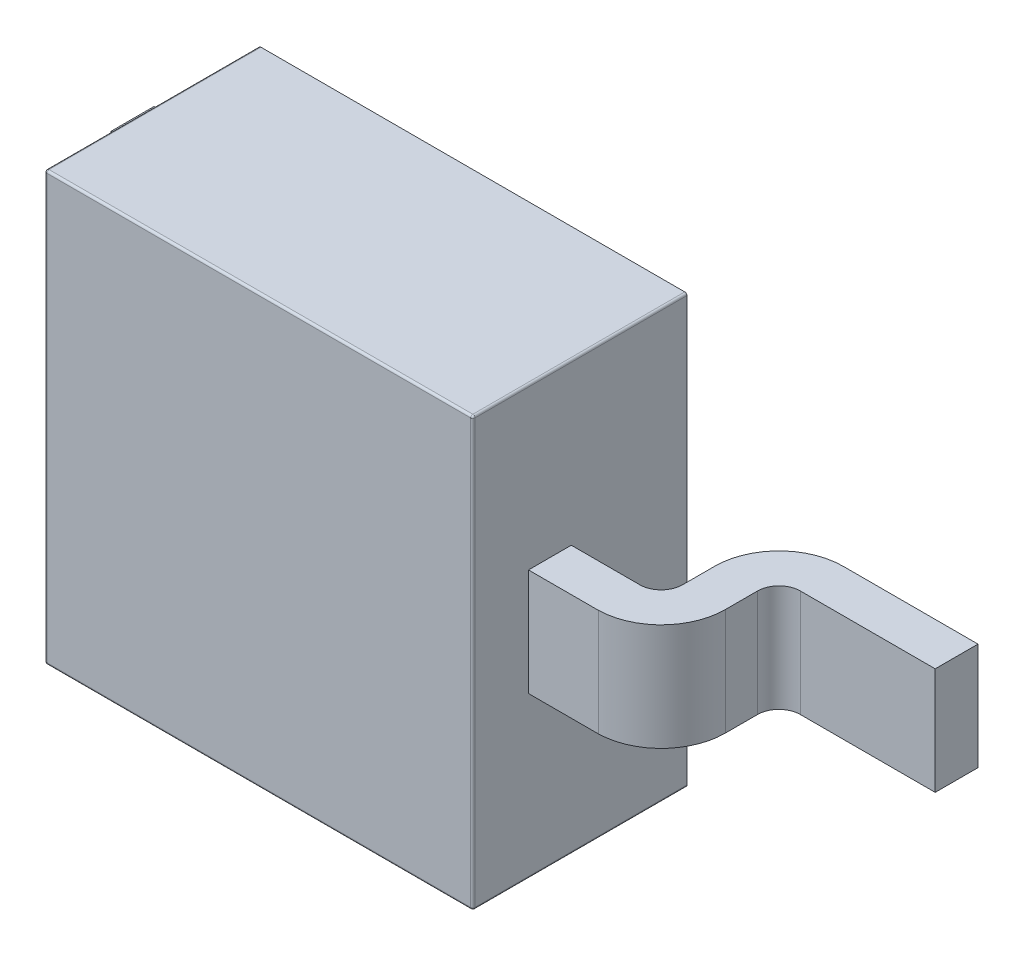
ISO-10303-21;
HEADER;
FILE_DESCRIPTION(('STEP AP214'),'2;1');
FILE_NAME('part.step','',(''),(''),'','','');
FILE_SCHEMA(('AUTOMOTIVE_DESIGN { 1 0 10303 214 1 1 1 1 }'));
ENDSEC;
DATA;
#1=APPLICATION_CONTEXT('core data for automotive mechanical design processes');
#2=APPLICATION_PROTOCOL_DEFINITION('international standard','automotive_design',2000,#1);
#3=PRODUCT_CONTEXT('',#1,'mechanical');
#4=PRODUCT('Part','Part','',(#3));
#5=PRODUCT_RELATED_PRODUCT_CATEGORY('part','',(#4));
#6=PRODUCT_DEFINITION_FORMATION('','',#4);
#7=PRODUCT_DEFINITION_CONTEXT('part definition',#1,'design');
#8=PRODUCT_DEFINITION('design','',#6,#7);
#9=PRODUCT_DEFINITION_SHAPE('','',#8);
#10=(LENGTH_UNIT() NAMED_UNIT(*) SI_UNIT(.MILLI.,.METRE.));
#11=(NAMED_UNIT(*) PLANE_ANGLE_UNIT() SI_UNIT($,.RADIAN.));
#12=(NAMED_UNIT(*) SI_UNIT($,.STERADIAN.) SOLID_ANGLE_UNIT());
#13=UNCERTAINTY_MEASURE_WITH_UNIT(LENGTH_MEASURE(1.E-05),#10,'distance_accuracy_value','');
#14=(GEOMETRIC_REPRESENTATION_CONTEXT(3) GLOBAL_UNCERTAINTY_ASSIGNED_CONTEXT((#13)) GLOBAL_UNIT_ASSIGNED_CONTEXT((#10,
#11,#12)) REPRESENTATION_CONTEXT('',''));
#15=CARTESIAN_POINT('',(0.,0.,0.));
#16=DIRECTION('',(0.,0.,1.));
#17=DIRECTION('',(1.,0.,0.));
#18=AXIS2_PLACEMENT_3D('',#15,#16,#17);
#19=CARTESIAN_POINT('',(1.,1.,1.01));
#20=DIRECTION('',(-1.,0.,0.));
#21=DIRECTION('',(0.,-1.,0.));
#22=AXIS2_PLACEMENT_3D('',#19,#20,#21);
#23=PLANE('',#22);
#24=DIRECTION('',(0.,1.,0.));
#25=VECTOR('',#24,1.);
#26=CARTESIAN_POINT('',(1.,-1.,1.));
#27=LINE('',#26,#25);
#28=CARTESIAN_POINT('',(1.,0.99,1.));
#29=VERTEX_POINT('',#28);
#30=CARTESIAN_POINT('',(1.,-0.99,1.));
#31=VERTEX_POINT('',#30);
#32=EDGE_CURVE('E399',#29,#31,#27,.F.);
#33=ORIENTED_EDGE('',*,*,#32,.T.);
#34=DIRECTION('',(0.,0.,-1.));
#35=VECTOR('',#34,1.);
#36=CARTESIAN_POINT('',(1.,-0.99,1.01));
#37=LINE('',#36,#35);
#38=CARTESIAN_POINT('',(1.,-0.99,0.01));
#39=VERTEX_POINT('',#38);
#40=EDGE_CURVE('E403',#31,#39,#37,.T.);
#41=ORIENTED_EDGE('',*,*,#40,.T.);
#42=DIRECTION('',(0.,1.,0.));
#43=VECTOR('',#42,1.);
#44=CARTESIAN_POINT('',(1.,1.,0.01));
#45=LINE('',#44,#43);
#46=CARTESIAN_POINT('',(1.,0.99,0.01));
#47=VERTEX_POINT('',#46);
#48=EDGE_CURVE('E341',#39,#47,#45,.T.);
#49=ORIENTED_EDGE('',*,*,#48,.T.);
#50=DIRECTION('',(0.,0.,-1.));
#51=VECTOR('',#50,1.);
#52=CARTESIAN_POINT('',(1.,0.99,1.01));
#53=LINE('',#52,#51);
#54=EDGE_CURVE('E401',#47,#29,#53,.F.);
#55=ORIENTED_EDGE('',*,*,#54,.T.);
#56=EDGE_LOOP('',(#33,#41,#49,#55));
#57=FACE_BOUND('',#56,.T.);
#58=DIRECTION('',(0.,0.,-1.));
#59=VECTOR('',#58,1.);
#60=CARTESIAN_POINT('',(1.,0.25,0.75));
#61=LINE('',#60,#59);
#62=CARTESIAN_POINT('',(1.,0.25,0.75));
#63=VERTEX_POINT('',#62);
#64=CARTESIAN_POINT('',(1.,0.25,0.550107802640043));
#65=VERTEX_POINT('',#64);
#66=EDGE_CURVE('E285',#63,#65,#61,.T.);
#67=ORIENTED_EDGE('',*,*,#66,.T.);
#68=DIRECTION('',(0.,-1.,0.));
#69=VECTOR('',#68,1.);
#70=CARTESIAN_POINT('',(1.,1.,0.550107802640043));
#71=LINE('',#70,#69);
#72=CARTESIAN_POINT('',(1.,-0.25,0.550107802640043));
#73=VERTEX_POINT('',#72);
#74=EDGE_CURVE('E224',#65,#73,#71,.T.);
#75=ORIENTED_EDGE('',*,*,#74,.T.);
#76=DIRECTION('',(0.,0.,-1.));
#77=VECTOR('',#76,1.);
#78=CARTESIAN_POINT('',(1.,-0.25,0.75));
#79=LINE('',#78,#77);
#80=CARTESIAN_POINT('',(1.,-0.25,0.75));
#81=VERTEX_POINT('',#80);
#82=EDGE_CURVE('E238',#81,#73,#79,.T.);
#83=ORIENTED_EDGE('',*,*,#82,.F.);
#84=DIRECTION('',(0.,-1.,0.));
#85=VECTOR('',#84,1.);
#86=CARTESIAN_POINT('',(1.,0.25,0.75));
#87=LINE('',#86,#85);
#88=EDGE_CURVE('E276',#63,#81,#87,.T.);
#89=ORIENTED_EDGE('',*,*,#88,.F.);
#90=EDGE_LOOP('',(#67,#75,#83,#89));
#91=FACE_BOUND('',#90,.T.);
#92=ADVANCED_FACE('F30',(#57,#91),#23,.F.);
#93=CARTESIAN_POINT('',(-1.,1.,1.01));
#94=DIRECTION('',(1.,0.,0.));
#95=DIRECTION('',(0.,0.,-1.));
#96=AXIS2_PLACEMENT_3D('',#93,#94,#95);
#97=PLANE('',#96);
#98=DIRECTION('',(0.,-1.,0.));
#99=VECTOR('',#98,1.);
#100=CARTESIAN_POINT('',(-1.,1.,0.01));
#101=LINE('',#100,#99);
#102=CARTESIAN_POINT('',(-1.,-0.5,0.01));
#103=VERTEX_POINT('',#102);
#104=CARTESIAN_POINT('',(-1.,-0.99,0.01));
#105=VERTEX_POINT('',#104);
#106=EDGE_CURVE('E335',#103,#105,#101,.T.);
#107=ORIENTED_EDGE('',*,*,#106,.T.);
#108=DIRECTION('',(0.,0.,-1.));
#109=VECTOR('',#108,1.);
#110=CARTESIAN_POINT('',(-1.,-0.99,1.01));
#111=LINE('',#110,#109);
#112=CARTESIAN_POINT('',(-1.,-0.99,1.));
#113=VERTEX_POINT('',#112);
#114=EDGE_CURVE('E397',#105,#113,#111,.F.);
#115=ORIENTED_EDGE('',*,*,#114,.T.);
#116=DIRECTION('',(0.,-1.,0.));
#117=VECTOR('',#116,1.);
#118=CARTESIAN_POINT('',(-1.,1.,1.));
#119=LINE('',#118,#117);
#120=CARTESIAN_POINT('',(-1.,0.99,1.));
#121=VERTEX_POINT('',#120);
#122=EDGE_CURVE('E393',#113,#121,#119,.F.);
#123=ORIENTED_EDGE('',*,*,#122,.T.);
#124=DIRECTION('',(0.,0.,-1.));
#125=VECTOR('',#124,1.);
#126=CARTESIAN_POINT('',(-1.,0.99,1.01));
#127=LINE('',#126,#125);
#128=CARTESIAN_POINT('',(-1.,0.99,0.01));
#129=VERTEX_POINT('',#128);
#130=EDGE_CURVE('E395',#121,#129,#127,.T.);
#131=ORIENTED_EDGE('',*,*,#130,.T.);
#132=CARTESIAN_POINT('',(-1.,0.5,0.01));
#133=VERTEX_POINT('',#132);
#134=EDGE_CURVE('E336',#129,#133,#101,.T.);
#135=ORIENTED_EDGE('',*,*,#134,.T.);
#136=DIRECTION('',(0.,0.,-1.));
#137=VECTOR('',#136,1.);
#138=CARTESIAN_POINT('',(-1.,0.5,1.01));
#139=LINE('',#138,#137);
#140=CARTESIAN_POINT('',(-1.,0.5,0.2));
#141=VERTEX_POINT('',#140);
#142=EDGE_CURVE('E329',#141,#133,#139,.T.);
#143=ORIENTED_EDGE('',*,*,#142,.F.);
#144=DIRECTION('',(0.,-1.,0.));
#145=VECTOR('',#144,1.);
#146=CARTESIAN_POINT('',(-1.,1.,0.2));
#147=LINE('',#146,#145);
#148=CARTESIAN_POINT('',(-1.,-0.5,0.2));
#149=VERTEX_POINT('',#148);
#150=EDGE_CURVE('E356',#141,#149,#147,.T.);
#151=ORIENTED_EDGE('',*,*,#150,.T.);
#152=DIRECTION('',(0.,0.,1.));
#153=VECTOR('',#152,1.);
#154=CARTESIAN_POINT('',(-1.,-0.5,1.01));
#155=LINE('',#154,#153);
#156=EDGE_CURVE('E332',#103,#149,#155,.T.);
#157=ORIENTED_EDGE('',*,*,#156,.F.);
#158=EDGE_LOOP('',(#107,#115,#123,#131,#135,#143,#151,#157));
#159=FACE_BOUND('',#158,.T.);
#160=ADVANCED_FACE('F512',(#159),#97,.F.);
#161=CARTESIAN_POINT('',(-1.,-1.,0.01));
#162=DIRECTION('',(0.,0.,1.));
#163=DIRECTION('',(1.,0.,0.));
#164=AXIS2_PLACEMENT_3D('',#161,#162,#163);
#165=PLANE('',#164);
#166=DIRECTION('',(1.,0.,0.));
#167=VECTOR('',#166,1.);
#168=CARTESIAN_POINT('',(-1.,-1.,0.01));
#169=LINE('',#168,#167);
#170=CARTESIAN_POINT('',(-0.99,-1.,0.01));
#171=VERTEX_POINT('',#170);
#172=CARTESIAN_POINT('',(0.99,-1.,0.01));
#173=VERTEX_POINT('',#172);
#174=EDGE_CURVE('E338',#171,#173,#169,.T.);
#175=ORIENTED_EDGE('',*,*,#174,.F.);
#176=CARTESIAN_POINT('',(-0.99,-0.99,0.01));
#177=DIRECTION('',(0.,0.,1.));
#178=DIRECTION('',(1.,0.,0.));
#179=AXIS2_PLACEMENT_3D('',#176,#177,#178);
#180=CIRCLE('',#179,0.01);
#181=EDGE_CURVE('E391',#171,#105,#180,.F.);
#182=ORIENTED_EDGE('',*,*,#181,.T.);
#183=ORIENTED_EDGE('',*,*,#106,.F.);
#184=DIRECTION('',(-1.,0.,0.));
#185=VECTOR('',#184,1.);
#186=CARTESIAN_POINT('',(-1.,-0.5,0.01));
#187=LINE('',#186,#185);
#188=CARTESIAN_POINT('',(0.5,-0.5,0.01));
#189=VERTEX_POINT('',#188);
#190=EDGE_CURVE('E353',#189,#103,#187,.T.);
#191=ORIENTED_EDGE('',*,*,#190,.F.);
#192=DIRECTION('',(0.,-1.,0.));
#193=VECTOR('',#192,1.);
#194=CARTESIAN_POINT('',(0.5,-1.,0.01));
#195=LINE('',#194,#193);
#196=CARTESIAN_POINT('',(0.5,0.5,0.01));
#197=VERTEX_POINT('',#196);
#198=EDGE_CURVE('E350',#197,#189,#195,.T.);
#199=ORIENTED_EDGE('',*,*,#198,.F.);
#200=DIRECTION('',(1.,0.,0.));
#201=VECTOR('',#200,1.);
#202=CARTESIAN_POINT('',(-1.,0.5,0.01));
#203=LINE('',#202,#201);
#204=EDGE_CURVE('E347',#133,#197,#203,.T.);
#205=ORIENTED_EDGE('',*,*,#204,.F.);
#206=ORIENTED_EDGE('',*,*,#134,.F.);
#207=CARTESIAN_POINT('',(-0.99,0.99,0.01));
#208=DIRECTION('',(0.,0.,1.));
#209=DIRECTION('',(1.,0.,0.));
#210=AXIS2_PLACEMENT_3D('',#207,#208,#209);
#211=CIRCLE('',#210,0.01);
#212=CARTESIAN_POINT('',(-0.99,1.,0.01));
#213=VERTEX_POINT('',#212);
#214=EDGE_CURVE('E387',#129,#213,#211,.F.);
#215=ORIENTED_EDGE('',*,*,#214,.T.);
#216=DIRECTION('',(-1.,0.,0.));
#217=VECTOR('',#216,1.);
#218=CARTESIAN_POINT('',(-1.,1.,0.01));
#219=LINE('',#218,#217);
#220=CARTESIAN_POINT('',(0.99,1.,0.01));
#221=VERTEX_POINT('',#220);
#222=EDGE_CURVE('E344',#221,#213,#219,.T.);
#223=ORIENTED_EDGE('',*,*,#222,.F.);
#224=CARTESIAN_POINT('',(0.99,0.99,0.01));
#225=DIRECTION('',(0.,0.,1.));
#226=DIRECTION('',(1.,0.,0.));
#227=AXIS2_PLACEMENT_3D('',#224,#225,#226);
#228=CIRCLE('',#227,0.01);
#229=EDGE_CURVE('E385',#221,#47,#228,.F.);
#230=ORIENTED_EDGE('',*,*,#229,.T.);
#231=ORIENTED_EDGE('',*,*,#48,.F.);
#232=CARTESIAN_POINT('',(0.99,-0.99,0.01));
#233=DIRECTION('',(0.,0.,1.));
#234=DIRECTION('',(1.,0.,0.));
#235=AXIS2_PLACEMENT_3D('',#232,#233,#234);
#236=CIRCLE('',#235,0.01);
#237=EDGE_CURVE('E389',#39,#173,#236,.F.);
#238=ORIENTED_EDGE('',*,*,#237,.T.);
#239=EDGE_LOOP('',(#175,#182,#183,#191,#199,#205,#206,#215,#223,#230,#231,#238));
#240=FACE_BOUND('',#239,.T.);
#241=ADVANCED_FACE('F463',(#240),#165,.F.);
#242=CARTESIAN_POINT('',(-1.,-1.,1.01));
#243=DIRECTION('',(0.,1.,0.));
#244=DIRECTION('',(0.,0.,1.));
#245=AXIS2_PLACEMENT_3D('',#242,#243,#244);
#246=PLANE('',#245);
#247=DIRECTION('',(1.,0.,0.));
#248=VECTOR('',#247,1.);
#249=CARTESIAN_POINT('',(-1.,-1.,1.));
#250=LINE('',#249,#248);
#251=CARTESIAN_POINT('',(0.99,-1.,1.));
#252=VERTEX_POINT('',#251);
#253=CARTESIAN_POINT('',(-0.99,-1.,1.));
#254=VERTEX_POINT('',#253);
#255=EDGE_CURVE('E378',#252,#254,#250,.F.);
#256=ORIENTED_EDGE('',*,*,#255,.T.);
#257=DIRECTION('',(0.,0.,-1.));
#258=VECTOR('',#257,1.);
#259=CARTESIAN_POINT('',(-0.99,-1.,1.01));
#260=LINE('',#259,#258);
#261=EDGE_CURVE('E382',#254,#171,#260,.T.);
#262=ORIENTED_EDGE('',*,*,#261,.T.);
#263=ORIENTED_EDGE('',*,*,#174,.T.);
#264=DIRECTION('',(0.,0.,-1.));
#265=VECTOR('',#264,1.);
#266=CARTESIAN_POINT('',(0.99,-1.,1.01));
#267=LINE('',#266,#265);
#268=EDGE_CURVE('E380',#173,#252,#267,.F.);
#269=ORIENTED_EDGE('',*,*,#268,.T.);
#270=EDGE_LOOP('',(#256,#262,#263,#269));
#271=FACE_BOUND('',#270,.T.);
#272=ADVANCED_FACE('F504',(#271),#246,.F.);
#273=CARTESIAN_POINT('',(-1.,1.,1.01));
#274=DIRECTION('',(0.,-1.,0.));
#275=DIRECTION('',(0.,0.,-1.));
#276=AXIS2_PLACEMENT_3D('',#273,#274,#275);
#277=PLANE('',#276);
#278=ORIENTED_EDGE('',*,*,#222,.T.);
#279=DIRECTION('',(0.,0.,-1.));
#280=VECTOR('',#279,1.);
#281=CARTESIAN_POINT('',(-0.99,1.,1.01));
#282=LINE('',#281,#280);
#283=CARTESIAN_POINT('',(-0.99,1.,1.));
#284=VERTEX_POINT('',#283);
#285=EDGE_CURVE('E409',#213,#284,#282,.F.);
#286=ORIENTED_EDGE('',*,*,#285,.T.);
#287=DIRECTION('',(-1.,0.,0.));
#288=VECTOR('',#287,1.);
#289=CARTESIAN_POINT('',(1.,1.,1.));
#290=LINE('',#289,#288);
#291=CARTESIAN_POINT('',(0.99,1.,1.));
#292=VERTEX_POINT('',#291);
#293=EDGE_CURVE('E405',#284,#292,#290,.F.);
#294=ORIENTED_EDGE('',*,*,#293,.T.);
#295=DIRECTION('',(0.,0.,-1.));
#296=VECTOR('',#295,1.);
#297=CARTESIAN_POINT('',(0.99,1.,1.01));
#298=LINE('',#297,#296);
#299=EDGE_CURVE('E407',#292,#221,#298,.T.);
#300=ORIENTED_EDGE('',*,*,#299,.T.);
#301=EDGE_LOOP('',(#278,#286,#294,#300));
#302=FACE_BOUND('',#301,.T.);
#303=ADVANCED_FACE('F459',(#302),#277,.F.);
#304=CARTESIAN_POINT('',(-1.,-1.,1.01));
#305=DIRECTION('',(0.,0.,1.));
#306=DIRECTION('',(1.,0.,0.));
#307=AXIS2_PLACEMENT_3D('',#304,#305,#306);
#308=PLANE('',#307);
#309=DIRECTION('',(0.,1.,0.));
#310=VECTOR('',#309,1.);
#311=CARTESIAN_POINT('',(0.99,1.,1.01));
#312=LINE('',#311,#310);
#313=CARTESIAN_POINT('',(0.99,-0.99,1.01));
#314=VERTEX_POINT('',#313);
#315=CARTESIAN_POINT('',(0.99,0.99,1.01));
#316=VERTEX_POINT('',#315);
#317=EDGE_CURVE('E39',#314,#316,#312,.T.);
#318=ORIENTED_EDGE('',*,*,#317,.T.);
#319=DIRECTION('',(-1.,0.,0.));
#320=VECTOR('',#319,1.);
#321=CARTESIAN_POINT('',(-1.,0.99,1.01));
#322=LINE('',#321,#320);
#323=CARTESIAN_POINT('',(-0.99,0.99,1.01));
#324=VERTEX_POINT('',#323);
#325=EDGE_CURVE('E11',#316,#324,#322,.T.);
#326=ORIENTED_EDGE('',*,*,#325,.T.);
#327=DIRECTION('',(0.,-1.,0.));
#328=VECTOR('',#327,1.);
#329=CARTESIAN_POINT('',(-0.99,-1.,1.01));
#330=LINE('',#329,#328);
#331=CARTESIAN_POINT('',(-0.99,-0.99,1.01));
#332=VERTEX_POINT('',#331);
#333=EDGE_CURVE('E413',#324,#332,#330,.T.);
#334=ORIENTED_EDGE('',*,*,#333,.T.);
#335=DIRECTION('',(1.,0.,0.));
#336=VECTOR('',#335,1.);
#337=CARTESIAN_POINT('',(1.,-0.99,1.01));
#338=LINE('',#337,#336);
#339=EDGE_CURVE('E411',#332,#314,#338,.T.);
#340=ORIENTED_EDGE('',*,*,#339,.T.);
#341=EDGE_LOOP('',(#318,#326,#334,#340));
#342=FACE_BOUND('',#341,.T.);
#343=ADVANCED_FACE('F482',(#342),#308,.T.);
#344=CARTESIAN_POINT('',(-1.5,-0.5,0.2));
#345=DIRECTION('',(0.,0.,1.));
#346=DIRECTION('',(1.,0.,0.));
#347=AXIS2_PLACEMENT_3D('',#344,#345,#346);
#348=PLANE('',#347);
#349=ORIENTED_EDGE('',*,*,#150,.F.);
#350=DIRECTION('',(-1.,0.,0.));
#351=VECTOR('',#350,1.);
#352=CARTESIAN_POINT('',(-1.5,0.5,0.2));
#353=LINE('',#352,#351);
#354=CARTESIAN_POINT('',(-1.5,0.5,0.2));
#355=VERTEX_POINT('',#354);
#356=EDGE_CURVE('E308',#141,#355,#353,.T.);
#357=ORIENTED_EDGE('',*,*,#356,.T.);
#358=DIRECTION('',(0.,-1.,0.));
#359=VECTOR('',#358,1.);
#360=CARTESIAN_POINT('',(-1.5,0.5,0.2));
#361=LINE('',#360,#359);
#362=CARTESIAN_POINT('',(-1.5,-0.5,0.2));
#363=VERTEX_POINT('',#362);
#364=EDGE_CURVE('E301',#355,#363,#361,.T.);
#365=ORIENTED_EDGE('',*,*,#364,.T.);
#366=DIRECTION('',(1.,0.,0.));
#367=VECTOR('',#366,1.);
#368=CARTESIAN_POINT('',(-1.5,-0.5,0.2));
#369=LINE('',#368,#367);
#370=EDGE_CURVE('E304',#363,#149,#369,.T.);
#371=ORIENTED_EDGE('',*,*,#370,.T.);
#372=EDGE_LOOP('',(#349,#357,#365,#371));
#373=FACE_BOUND('',#372,.T.);
#374=ADVANCED_FACE('F518',(#373),#348,.T.);
#375=CARTESIAN_POINT('',(-1.5,-0.5,0.2));
#376=DIRECTION('',(0.,1.,0.));
#377=DIRECTION('',(0.,0.,1.));
#378=AXIS2_PLACEMENT_3D('',#375,#376,#377);
#379=PLANE('',#378);
#380=ORIENTED_EDGE('',*,*,#190,.T.);
#381=ORIENTED_EDGE('',*,*,#156,.T.);
#382=ORIENTED_EDGE('',*,*,#370,.F.);
#383=DIRECTION('',(0.,0.,-1.));
#384=VECTOR('',#383,1.);
#385=CARTESIAN_POINT('',(-1.5,-0.5,0.2));
#386=LINE('',#385,#384);
#387=CARTESIAN_POINT('',(-1.5,-0.5,0.));
#388=VERTEX_POINT('',#387);
#389=EDGE_CURVE('E326',#363,#388,#386,.T.);
#390=ORIENTED_EDGE('',*,*,#389,.T.);
#391=DIRECTION('',(1.,0.,0.));
#392=VECTOR('',#391,1.);
#393=CARTESIAN_POINT('',(-1.5,-0.5,0.));
#394=LINE('',#393,#392);
#395=CARTESIAN_POINT('',(0.5,-0.5,0.));
#396=VERTEX_POINT('',#395);
#397=EDGE_CURVE('E313',#388,#396,#394,.T.);
#398=ORIENTED_EDGE('',*,*,#397,.T.);
#399=DIRECTION('',(0.,0.,-1.));
#400=VECTOR('',#399,1.);
#401=CARTESIAN_POINT('',(0.5,-0.5,0.2));
#402=LINE('',#401,#400);
#403=EDGE_CURVE('E324',#189,#396,#402,.T.);
#404=ORIENTED_EDGE('',*,*,#403,.F.);
#405=EDGE_LOOP('',(#380,#381,#382,#390,#398,#404));
#406=FACE_BOUND('',#405,.T.);
#407=ADVANCED_FACE('F515',(#406),#379,.F.);
#408=CARTESIAN_POINT('',(0.5,0.5,0.2));
#409=DIRECTION('',(-1.,0.,0.));
#410=DIRECTION('',(0.,-1.,0.));
#411=AXIS2_PLACEMENT_3D('',#408,#409,#410);
#412=PLANE('',#411);
#413=DIRECTION('',(0.,0.,-1.));
#414=VECTOR('',#413,1.);
#415=CARTESIAN_POINT('',(0.5,0.5,0.2));
#416=LINE('',#415,#414);
#417=CARTESIAN_POINT('',(0.5,0.5,0.));
#418=VERTEX_POINT('',#417);
#419=EDGE_CURVE('E322',#197,#418,#416,.T.);
#420=ORIENTED_EDGE('',*,*,#419,.F.);
#421=ORIENTED_EDGE('',*,*,#198,.T.);
#422=ORIENTED_EDGE('',*,*,#403,.T.);
#423=DIRECTION('',(0.,1.,0.));
#424=VECTOR('',#423,1.);
#425=CARTESIAN_POINT('',(0.5,0.5,0.));
#426=LINE('',#425,#424);
#427=EDGE_CURVE('E316',#396,#418,#426,.T.);
#428=ORIENTED_EDGE('',*,*,#427,.T.);
#429=EDGE_LOOP('',(#420,#421,#422,#428));
#430=FACE_BOUND('',#429,.T.);
#431=ADVANCED_FACE('F532',(#430),#412,.F.);
#432=CARTESIAN_POINT('',(-1.5,0.5,0.2));
#433=DIRECTION('',(0.,-1.,0.));
#434=DIRECTION('',(0.,0.,-1.));
#435=AXIS2_PLACEMENT_3D('',#432,#433,#434);
#436=PLANE('',#435);
#437=ORIENTED_EDGE('',*,*,#356,.F.);
#438=ORIENTED_EDGE('',*,*,#142,.T.);
#439=ORIENTED_EDGE('',*,*,#204,.T.);
#440=ORIENTED_EDGE('',*,*,#419,.T.);
#441=DIRECTION('',(-1.,0.,0.));
#442=VECTOR('',#441,1.);
#443=CARTESIAN_POINT('',(-1.5,0.5,0.));
#444=LINE('',#443,#442);
#445=CARTESIAN_POINT('',(-1.5,0.5,0.));
#446=VERTEX_POINT('',#445);
#447=EDGE_CURVE('E305',#418,#446,#444,.T.);
#448=ORIENTED_EDGE('',*,*,#447,.T.);
#449=DIRECTION('',(0.,0.,-1.));
#450=VECTOR('',#449,1.);
#451=CARTESIAN_POINT('',(-1.5,0.5,0.2));
#452=LINE('',#451,#450);
#453=EDGE_CURVE('E310',#355,#446,#452,.T.);
#454=ORIENTED_EDGE('',*,*,#453,.F.);
#455=EDGE_LOOP('',(#437,#438,#439,#440,#448,#454));
#456=FACE_BOUND('',#455,.T.);
#457=ADVANCED_FACE('F534',(#456),#436,.F.);
#458=CARTESIAN_POINT('',(-1.5,0.5,0.2));
#459=DIRECTION('',(1.,0.,0.));
#460=DIRECTION('',(0.,1.,0.));
#461=AXIS2_PLACEMENT_3D('',#458,#459,#460);
#462=PLANE('',#461);
#463=DIRECTION('',(0.,-1.,0.));
#464=VECTOR('',#463,1.);
#465=CARTESIAN_POINT('',(-1.5,0.5,0.));
#466=LINE('',#465,#464);
#467=EDGE_CURVE('E300',#446,#388,#466,.T.);
#468=ORIENTED_EDGE('',*,*,#467,.T.);
#469=ORIENTED_EDGE('',*,*,#389,.F.);
#470=ORIENTED_EDGE('',*,*,#364,.F.);
#471=ORIENTED_EDGE('',*,*,#453,.T.);
#472=EDGE_LOOP('',(#468,#469,#470,#471));
#473=FACE_BOUND('',#472,.T.);
#474=ADVANCED_FACE('F524',(#473),#462,.F.);
#475=CARTESIAN_POINT('',(-1.5,-0.5,0.));
#476=DIRECTION('',(0.,0.,1.));
#477=DIRECTION('',(1.,0.,0.));
#478=AXIS2_PLACEMENT_3D('',#475,#476,#477);
#479=PLANE('',#478);
#480=ORIENTED_EDGE('',*,*,#467,.F.);
#481=ORIENTED_EDGE('',*,*,#447,.F.);
#482=ORIENTED_EDGE('',*,*,#427,.F.);
#483=ORIENTED_EDGE('',*,*,#397,.F.);
#484=EDGE_LOOP('',(#480,#481,#482,#483));
#485=FACE_BOUND('',#484,.T.);
#486=ADVANCED_FACE('F529',(#485),#479,.F.);
#487=CARTESIAN_POINT('',(1.,-0.25,0.75));
#488=DIRECTION('',(0.,1.,0.));
#489=DIRECTION('',(0.,0.,1.));
#490=AXIS2_PLACEMENT_3D('',#487,#488,#489);
#491=PLANE('',#490);
#492=DIRECTION('',(0.,0.,1.));
#493=VECTOR('',#492,1.);
#494=CARTESIAN_POINT('',(1.42,-0.25,0.3));
#495=LINE('',#494,#493);
#496=CARTESIAN_POINT('',(1.42,-0.25,0.3));
#497=VERTEX_POINT('',#496);
#498=CARTESIAN_POINT('',(1.42,-0.25,0.450107802640042));
#499=VERTEX_POINT('',#498);
#500=EDGE_CURVE('E225',#497,#499,#495,.T.);
#501=ORIENTED_EDGE('',*,*,#500,.F.);
#502=CARTESIAN_POINT('',(1.72,-0.25,0.3));
#503=DIRECTION('',(0.,1.,0.));
#504=DIRECTION('',(0.,0.,1.));
#505=AXIS2_PLACEMENT_3D('',#502,#503,#504);
#506=CIRCLE('',#505,0.3);
#507=CARTESIAN_POINT('',(1.72,-0.25,0.));
#508=VERTEX_POINT('',#507);
#509=EDGE_CURVE('E239',#508,#497,#506,.T.);
#510=ORIENTED_EDGE('',*,*,#509,.F.);
#511=DIRECTION('',(1.,0.,0.));
#512=VECTOR('',#511,1.);
#513=CARTESIAN_POINT('',(1.,-0.25,0.));
#514=LINE('',#513,#512);
#515=CARTESIAN_POINT('',(2.35,-0.25,0.));
#516=VERTEX_POINT('',#515);
#517=EDGE_CURVE('E275',#508,#516,#514,.T.);
#518=ORIENTED_EDGE('',*,*,#517,.T.);
#519=DIRECTION('',(0.,0.,-1.));
#520=VECTOR('',#519,1.);
#521=CARTESIAN_POINT('',(2.35,-0.25,0.75));
#522=LINE('',#521,#520);
#523=CARTESIAN_POINT('',(2.35,-0.25,0.2));
#524=VERTEX_POINT('',#523);
#525=EDGE_CURVE('E296',#524,#516,#522,.T.);
#526=ORIENTED_EDGE('',*,*,#525,.F.);
#527=DIRECTION('',(1.,0.,0.));
#528=VECTOR('',#527,1.);
#529=CARTESIAN_POINT('',(2.35,-0.25,0.2));
#530=LINE('',#529,#528);
#531=CARTESIAN_POINT('',(1.72,-0.25,0.2));
#532=VERTEX_POINT('',#531);
#533=EDGE_CURVE('E261',#532,#524,#530,.T.);
#534=ORIENTED_EDGE('',*,*,#533,.F.);
#535=CARTESIAN_POINT('',(1.72,-0.25,0.3));
#536=DIRECTION('',(0.,-1.,0.));
#537=DIRECTION('',(0.,0.,1.));
#538=AXIS2_PLACEMENT_3D('',#535,#536,#537);
#539=CIRCLE('',#538,0.1);
#540=CARTESIAN_POINT('',(1.62,-0.25,0.3));
#541=VERTEX_POINT('',#540);
#542=EDGE_CURVE('E258',#541,#532,#539,.T.);
#543=ORIENTED_EDGE('',*,*,#542,.F.);
#544=DIRECTION('',(0.,0.,-1.));
#545=VECTOR('',#544,1.);
#546=CARTESIAN_POINT('',(1.62,-0.25,0.45010780264004));
#547=LINE('',#546,#545);
#548=CARTESIAN_POINT('',(1.62,-0.25,0.45010780264004));
#549=VERTEX_POINT('',#548);
#550=EDGE_CURVE('E255',#549,#541,#547,.T.);
#551=ORIENTED_EDGE('',*,*,#550,.F.);
#552=CARTESIAN_POINT('',(1.32,-0.25,0.450107802640043));
#553=DIRECTION('',(0.,1.,0.));
#554=DIRECTION('',(0.,0.,-1.));
#555=AXIS2_PLACEMENT_3D('',#552,#553,#554);
#556=CIRCLE('',#555,0.3);
#557=CARTESIAN_POINT('',(1.32804176365087,-0.25,0.75));
#558=VERTEX_POINT('',#557);
#559=EDGE_CURVE('E252',#558,#549,#556,.T.);
#560=ORIENTED_EDGE('',*,*,#559,.F.);
#561=DIRECTION('',(1.,0.,0.));
#562=VECTOR('',#561,1.);
#563=CARTESIAN_POINT('',(1.,-0.25,0.75));
#564=LINE('',#563,#562);
#565=EDGE_CURVE('E279',#81,#558,#564,.T.);
#566=ORIENTED_EDGE('',*,*,#565,.F.);
#567=ORIENTED_EDGE('',*,*,#82,.T.);
#568=DIRECTION('',(-1.,0.,0.));
#569=VECTOR('',#568,1.);
#570=CARTESIAN_POINT('',(1.32,-0.25,0.550107802640043));
#571=LINE('',#570,#569);
#572=CARTESIAN_POINT('',(1.32,-0.25,0.550107802640043));
#573=VERTEX_POINT('',#572);
#574=EDGE_CURVE('E218',#573,#73,#571,.T.);
#575=ORIENTED_EDGE('',*,*,#574,.F.);
#576=CARTESIAN_POINT('',(1.32,-0.25,0.450107802640043));
#577=DIRECTION('',(0.,-1.,0.));
#578=DIRECTION('',(0.,0.,-1.));
#579=AXIS2_PLACEMENT_3D('',#576,#577,#578);
#580=CIRCLE('',#579,0.1);
#581=EDGE_CURVE('E228',#499,#573,#580,.T.);
#582=ORIENTED_EDGE('',*,*,#581,.F.);
#583=EDGE_LOOP('',(#501,#510,#518,#526,#534,#543,#551,#560,#566,#567,#575,#582));
#584=FACE_BOUND('',#583,.T.);
#585=ADVANCED_FACE('F236',(#584),#491,.F.);
#586=CARTESIAN_POINT('',(2.35,0.25,0.75));
#587=DIRECTION('',(-1.,0.,0.));
#588=DIRECTION('',(0.,0.,1.));
#589=AXIS2_PLACEMENT_3D('',#586,#587,#588);
#590=PLANE('',#589);
#591=DIRECTION('',(0.,0.,-1.));
#592=VECTOR('',#591,1.);
#593=CARTESIAN_POINT('',(2.35,0.25,0.75));
#594=LINE('',#593,#592);
#595=CARTESIAN_POINT('',(2.35,0.25,0.2));
#596=VERTEX_POINT('',#595);
#597=CARTESIAN_POINT('',(2.35,0.25,0.));
#598=VERTEX_POINT('',#597);
#599=EDGE_CURVE('E294',#596,#598,#594,.T.);
#600=ORIENTED_EDGE('',*,*,#599,.F.);
#601=DIRECTION('',(0.,-1.,0.));
#602=VECTOR('',#601,1.);
#603=CARTESIAN_POINT('',(2.35,1.,0.2));
#604=LINE('',#603,#602);
#605=EDGE_CURVE('E264',#596,#524,#604,.T.);
#606=ORIENTED_EDGE('',*,*,#605,.T.);
#607=ORIENTED_EDGE('',*,*,#525,.T.);
#608=DIRECTION('',(0.,1.,0.));
#609=VECTOR('',#608,1.);
#610=CARTESIAN_POINT('',(2.35,0.25,0.));
#611=LINE('',#610,#609);
#612=EDGE_CURVE('E287',#516,#598,#611,.T.);
#613=ORIENTED_EDGE('',*,*,#612,.T.);
#614=EDGE_LOOP('',(#600,#606,#607,#613));
#615=FACE_BOUND('',#614,.T.);
#616=ADVANCED_FACE('F578',(#615),#590,.F.);
#617=CARTESIAN_POINT('',(1.,0.25,0.75));
#618=DIRECTION('',(0.,-1.,0.));
#619=DIRECTION('',(0.,0.,-1.));
#620=AXIS2_PLACEMENT_3D('',#617,#618,#619);
#621=PLANE('',#620);
#622=DIRECTION('',(-1.,0.,0.));
#623=VECTOR('',#622,1.);
#624=CARTESIAN_POINT('',(1.,0.25,0.));
#625=LINE('',#624,#623);
#626=CARTESIAN_POINT('',(1.72,0.25,0.));
#627=VERTEX_POINT('',#626);
#628=EDGE_CURVE('E280',#598,#627,#625,.T.);
#629=ORIENTED_EDGE('',*,*,#628,.T.);
#630=CARTESIAN_POINT('',(1.72,0.25,0.3));
#631=DIRECTION('',(0.,-1.,0.));
#632=DIRECTION('',(0.,0.,-1.));
#633=AXIS2_PLACEMENT_3D('',#630,#631,#632);
#634=CIRCLE('',#633,0.3);
#635=CARTESIAN_POINT('',(1.42,0.25,0.3));
#636=VERTEX_POINT('',#635);
#637=EDGE_CURVE('E246',#627,#636,#634,.F.);
#638=ORIENTED_EDGE('',*,*,#637,.T.);
#639=DIRECTION('',(0.,0.,1.));
#640=VECTOR('',#639,1.);
#641=CARTESIAN_POINT('',(1.42,0.25,0.749999999999999));
#642=LINE('',#641,#640);
#643=CARTESIAN_POINT('',(1.42,0.25,0.450107802640042));
#644=VERTEX_POINT('',#643);
#645=EDGE_CURVE('E375',#636,#644,#642,.T.);
#646=ORIENTED_EDGE('',*,*,#645,.T.);
#647=CARTESIAN_POINT('',(1.32,0.25,0.450107802640043));
#648=DIRECTION('',(0.,-1.,0.));
#649=DIRECTION('',(0.,0.,-1.));
#650=AXIS2_PLACEMENT_3D('',#647,#648,#649);
#651=CIRCLE('',#650,0.1);
#652=CARTESIAN_POINT('',(1.32,0.25,0.550107802640043));
#653=VERTEX_POINT('',#652);
#654=EDGE_CURVE('E373',#644,#653,#651,.T.);
#655=ORIENTED_EDGE('',*,*,#654,.T.);
#656=DIRECTION('',(-1.,0.,0.));
#657=VECTOR('',#656,1.);
#658=CARTESIAN_POINT('',(1.,0.25,0.550107802640043));
#659=LINE('',#658,#657);
#660=EDGE_CURVE('E221',#653,#65,#659,.T.);
#661=ORIENTED_EDGE('',*,*,#660,.T.);
#662=ORIENTED_EDGE('',*,*,#66,.F.);
#663=DIRECTION('',(-1.,0.,0.));
#664=VECTOR('',#663,1.);
#665=CARTESIAN_POINT('',(1.,0.25,0.75));
#666=LINE('',#665,#664);
#667=CARTESIAN_POINT('',(1.32804176365087,0.25,0.75));
#668=VERTEX_POINT('',#667);
#669=EDGE_CURVE('E283',#668,#63,#666,.T.);
#670=ORIENTED_EDGE('',*,*,#669,.F.);
#671=CARTESIAN_POINT('',(1.32,0.25,0.450107802640043));
#672=DIRECTION('',(0.,-1.,0.));
#673=DIRECTION('',(0.,0.,-1.));
#674=AXIS2_PLACEMENT_3D('',#671,#672,#673);
#675=CIRCLE('',#674,0.3);
#676=CARTESIAN_POINT('',(1.62,0.25,0.45010780264004));
#677=VERTEX_POINT('',#676);
#678=EDGE_CURVE('E267',#668,#677,#675,.F.);
#679=ORIENTED_EDGE('',*,*,#678,.T.);
#680=DIRECTION('',(0.,0.,-1.));
#681=VECTOR('',#680,1.);
#682=CARTESIAN_POINT('',(1.62,0.25,0.75));
#683=LINE('',#682,#681);
#684=CARTESIAN_POINT('',(1.62,0.25,0.3));
#685=VERTEX_POINT('',#684);
#686=EDGE_CURVE('E360',#677,#685,#683,.T.);
#687=ORIENTED_EDGE('',*,*,#686,.T.);
#688=CARTESIAN_POINT('',(1.72,0.25,0.3));
#689=DIRECTION('',(0.,-1.,0.));
#690=DIRECTION('',(0.,0.,-1.));
#691=AXIS2_PLACEMENT_3D('',#688,#689,#690);
#692=CIRCLE('',#691,0.1);
#693=CARTESIAN_POINT('',(1.72,0.25,0.2));
#694=VERTEX_POINT('',#693);
#695=EDGE_CURVE('E363',#685,#694,#692,.T.);
#696=ORIENTED_EDGE('',*,*,#695,.T.);
#697=DIRECTION('',(1.,0.,0.));
#698=VECTOR('',#697,1.);
#699=CARTESIAN_POINT('',(1.,0.25,0.2));
#700=LINE('',#699,#698);
#701=EDGE_CURVE('E366',#694,#596,#700,.T.);
#702=ORIENTED_EDGE('',*,*,#701,.T.);
#703=ORIENTED_EDGE('',*,*,#599,.T.);
#704=EDGE_LOOP('',(#629,#638,#646,#655,#661,#662,#670,#679,#687,#696,#702,#703));
#705=FACE_BOUND('',#704,.T.);
#706=ADVANCED_FACE('F581',(#705),#621,.F.);
#707=CARTESIAN_POINT('',(1.,-0.25,0.75));
#708=DIRECTION('',(0.,0.,1.));
#709=DIRECTION('',(1.,0.,0.));
#710=AXIS2_PLACEMENT_3D('',#707,#708,#709);
#711=PLANE('',#710);
#712=DIRECTION('',(0.,-1.,0.));
#713=VECTOR('',#712,1.);
#714=CARTESIAN_POINT('',(1.32804176365087,1.,0.75));
#715=LINE('',#714,#713);
#716=EDGE_CURVE('E358',#668,#558,#715,.T.);
#717=ORIENTED_EDGE('',*,*,#716,.F.);
#718=ORIENTED_EDGE('',*,*,#669,.T.);
#719=ORIENTED_EDGE('',*,*,#88,.T.);
#720=ORIENTED_EDGE('',*,*,#565,.T.);
#721=EDGE_LOOP('',(#717,#718,#719,#720));
#722=FACE_BOUND('',#721,.T.);
#723=ADVANCED_FACE('F585',(#722),#711,.T.);
#724=CARTESIAN_POINT('',(1.,-0.25,0.));
#725=DIRECTION('',(0.,0.,1.));
#726=DIRECTION('',(1.,0.,0.));
#727=AXIS2_PLACEMENT_3D('',#724,#725,#726);
#728=PLANE('',#727);
#729=ORIENTED_EDGE('',*,*,#517,.F.);
#730=DIRECTION('',(0.,-1.,0.));
#731=VECTOR('',#730,1.);
#732=CARTESIAN_POINT('',(1.72,1.,0.));
#733=LINE('',#732,#731);
#734=EDGE_CURVE('E369',#508,#627,#733,.F.);
#735=ORIENTED_EDGE('',*,*,#734,.T.);
#736=ORIENTED_EDGE('',*,*,#628,.F.);
#737=ORIENTED_EDGE('',*,*,#612,.F.);
#738=EDGE_LOOP('',(#729,#735,#736,#737));
#739=FACE_BOUND('',#738,.T.);
#740=ADVANCED_FACE('F587',(#739),#728,.F.);
#741=CARTESIAN_POINT('',(2.35,1.,0.2));
#742=DIRECTION('',(0.,0.,-1.));
#743=DIRECTION('',(-1.,0.,0.));
#744=AXIS2_PLACEMENT_3D('',#741,#742,#743);
#745=PLANE('',#744);
#746=DIRECTION('',(0.,-1.,0.));
#747=VECTOR('',#746,1.);
#748=CARTESIAN_POINT('',(1.72,1.,0.2));
#749=LINE('',#748,#747);
#750=EDGE_CURVE('E268',#694,#532,#749,.T.);
#751=ORIENTED_EDGE('',*,*,#750,.T.);
#752=ORIENTED_EDGE('',*,*,#533,.T.);
#753=ORIENTED_EDGE('',*,*,#605,.F.);
#754=ORIENTED_EDGE('',*,*,#701,.F.);
#755=EDGE_LOOP('',(#751,#752,#753,#754));
#756=FACE_BOUND('',#755,.T.);
#757=ADVANCED_FACE('F590',(#756),#745,.F.);
#758=CARTESIAN_POINT('',(1.72,1.,0.3));
#759=DIRECTION('',(0.,-1.,0.));
#760=DIRECTION('',(0.,0.,-1.));
#761=AXIS2_PLACEMENT_3D('',#758,#759,#760);
#762=CYLINDRICAL_SURFACE('',#761,0.1);
#763=DIRECTION('',(0.,-1.,0.));
#764=VECTOR('',#763,1.);
#765=CARTESIAN_POINT('',(1.62,1.,0.3));
#766=LINE('',#765,#764);
#767=EDGE_CURVE('E270',#685,#541,#766,.T.);
#768=ORIENTED_EDGE('',*,*,#767,.T.);
#769=ORIENTED_EDGE('',*,*,#542,.T.);
#770=ORIENTED_EDGE('',*,*,#750,.F.);
#771=ORIENTED_EDGE('',*,*,#695,.F.);
#772=EDGE_LOOP('',(#768,#769,#770,#771));
#773=FACE_BOUND('',#772,.T.);
#774=ADVANCED_FACE('F602',(#773),#762,.F.);
#775=CARTESIAN_POINT('',(1.62,1.,0.45010780264004));
#776=DIRECTION('',(-1.,0.,0.));
#777=DIRECTION('',(0.,0.,1.));
#778=AXIS2_PLACEMENT_3D('',#775,#776,#777);
#779=PLANE('',#778);
#780=DIRECTION('',(0.,-1.,0.));
#781=VECTOR('',#780,1.);
#782=CARTESIAN_POINT('',(1.62,1.,0.45010780264004));
#783=LINE('',#782,#781);
#784=EDGE_CURVE('E263',#677,#549,#783,.T.);
#785=ORIENTED_EDGE('',*,*,#784,.T.);
#786=ORIENTED_EDGE('',*,*,#550,.T.);
#787=ORIENTED_EDGE('',*,*,#767,.F.);
#788=ORIENTED_EDGE('',*,*,#686,.F.);
#789=EDGE_LOOP('',(#785,#786,#787,#788));
#790=FACE_BOUND('',#789,.T.);
#791=ADVANCED_FACE('F598',(#790),#779,.F.);
#792=CARTESIAN_POINT('',(1.32,1.,0.450107802640043));
#793=DIRECTION('',(0.,-1.,0.));
#794=DIRECTION('',(0.,0.,-1.));
#795=AXIS2_PLACEMENT_3D('',#792,#793,#794);
#796=CYLINDRICAL_SURFACE('',#795,0.3);
#797=ORIENTED_EDGE('',*,*,#716,.T.);
#798=ORIENTED_EDGE('',*,*,#559,.T.);
#799=ORIENTED_EDGE('',*,*,#784,.F.);
#800=ORIENTED_EDGE('',*,*,#678,.F.);
#801=EDGE_LOOP('',(#797,#798,#799,#800));
#802=FACE_BOUND('',#801,.T.);
#803=ADVANCED_FACE('F595',(#802),#796,.T.);
#804=CARTESIAN_POINT('',(1.32,1.,0.450107802640043));
#805=DIRECTION('',(0.,-1.,0.));
#806=DIRECTION('',(0.,0.,-1.));
#807=AXIS2_PLACEMENT_3D('',#804,#805,#806);
#808=CYLINDRICAL_SURFACE('',#807,0.1);
#809=DIRECTION('',(0.,-1.,0.));
#810=VECTOR('',#809,1.);
#811=CARTESIAN_POINT('',(1.42,1.,0.450107802640042));
#812=LINE('',#811,#810);
#813=EDGE_CURVE('E231',#644,#499,#812,.T.);
#814=ORIENTED_EDGE('',*,*,#813,.T.);
#815=ORIENTED_EDGE('',*,*,#581,.T.);
#816=DIRECTION('',(0.,-1.,0.));
#817=VECTOR('',#816,1.);
#818=CARTESIAN_POINT('',(1.32,1.,0.550107802640043));
#819=LINE('',#818,#817);
#820=EDGE_CURVE('E214',#653,#573,#819,.T.);
#821=ORIENTED_EDGE('',*,*,#820,.F.);
#822=ORIENTED_EDGE('',*,*,#654,.F.);
#823=EDGE_LOOP('',(#814,#815,#821,#822));
#824=FACE_BOUND('',#823,.T.);
#825=ADVANCED_FACE('F229',(#824),#808,.F.);
#826=CARTESIAN_POINT('',(1.42,1.,0.3));
#827=DIRECTION('',(1.,0.,0.));
#828=DIRECTION('',(0.,0.,-1.));
#829=AXIS2_PLACEMENT_3D('',#826,#827,#828);
#830=PLANE('',#829);
#831=DIRECTION('',(0.,-1.,0.));
#832=VECTOR('',#831,1.);
#833=CARTESIAN_POINT('',(1.42,1.,0.3));
#834=LINE('',#833,#832);
#835=EDGE_CURVE('E247',#636,#497,#834,.T.);
#836=ORIENTED_EDGE('',*,*,#835,.T.);
#837=ORIENTED_EDGE('',*,*,#500,.T.);
#838=ORIENTED_EDGE('',*,*,#813,.F.);
#839=ORIENTED_EDGE('',*,*,#645,.F.);
#840=EDGE_LOOP('',(#836,#837,#838,#839));
#841=FACE_BOUND('',#840,.T.);
#842=ADVANCED_FACE('F612',(#841),#830,.F.);
#843=CARTESIAN_POINT('',(1.32,1.,0.550107802640043));
#844=DIRECTION('',(0.,0.,1.));
#845=DIRECTION('',(1.,0.,0.));
#846=AXIS2_PLACEMENT_3D('',#843,#844,#845);
#847=PLANE('',#846);
#848=ORIENTED_EDGE('',*,*,#820,.T.);
#849=ORIENTED_EDGE('',*,*,#574,.T.);
#850=ORIENTED_EDGE('',*,*,#74,.F.);
#851=ORIENTED_EDGE('',*,*,#660,.F.);
#852=EDGE_LOOP('',(#848,#849,#850,#851));
#853=FACE_BOUND('',#852,.T.);
#854=ADVANCED_FACE('F216',(#853),#847,.F.);
#855=CARTESIAN_POINT('',(1.72,1.,0.3));
#856=DIRECTION('',(0.,-1.,0.));
#857=DIRECTION('',(0.,0.,-1.));
#858=AXIS2_PLACEMENT_3D('',#855,#856,#857);
#859=CYLINDRICAL_SURFACE('',#858,0.3);
#860=ORIENTED_EDGE('',*,*,#734,.F.);
#861=ORIENTED_EDGE('',*,*,#509,.T.);
#862=ORIENTED_EDGE('',*,*,#835,.F.);
#863=ORIENTED_EDGE('',*,*,#637,.F.);
#864=EDGE_LOOP('',(#860,#861,#862,#863));
#865=FACE_BOUND('',#864,.T.);
#866=ADVANCED_FACE('F615',(#865),#859,.T.);
#867=CARTESIAN_POINT('',(0.99,0.99,1.01));
#868=DIRECTION('',(0.,0.,-1.));
#869=DIRECTION('',(-1.,0.,0.));
#870=AXIS2_PLACEMENT_3D('',#867,#868,#869);
#871=CYLINDRICAL_SURFACE('',#870,0.01);
#872=CARTESIAN_POINT('',(0.99,0.99,1.));
#873=DIRECTION('',(0.,0.,1.));
#874=DIRECTION('',(1.,0.,0.));
#875=AXIS2_PLACEMENT_3D('',#872,#873,#874);
#876=CIRCLE('',#875,0.01);
#877=EDGE_CURVE('E34',#29,#292,#876,.T.);
#878=ORIENTED_EDGE('',*,*,#877,.F.);
#879=ORIENTED_EDGE('',*,*,#54,.F.);
#880=ORIENTED_EDGE('',*,*,#229,.F.);
#881=ORIENTED_EDGE('',*,*,#299,.F.);
#882=EDGE_LOOP('',(#878,#879,#880,#881));
#883=FACE_BOUND('',#882,.T.);
#884=ADVANCED_FACE('F32',(#883),#871,.T.);
#885=CARTESIAN_POINT('',(0.99,0.99,1.));
#886=DIRECTION('',(0.,0.,1.));
#887=DIRECTION('',(1.,0.,0.));
#888=AXIS2_PLACEMENT_3D('',#885,#886,#887);
#889=SPHERICAL_SURFACE('',#888,0.01);
#890=CARTESIAN_POINT('',(0.99,0.99,1.));
#891=DIRECTION('',(0.,1.,0.));
#892=DIRECTION('',(0.,0.,1.));
#893=AXIS2_PLACEMENT_3D('',#890,#891,#892);
#894=CIRCLE('',#893,0.01);
#895=EDGE_CURVE('E443',#29,#316,#894,.F.);
#896=ORIENTED_EDGE('',*,*,#895,.F.);
#897=ORIENTED_EDGE('',*,*,#877,.T.);
#898=CARTESIAN_POINT('',(0.99,0.99,1.));
#899=DIRECTION('',(1.,0.,0.));
#900=DIRECTION('',(0.,0.,-1.));
#901=AXIS2_PLACEMENT_3D('',#898,#899,#900);
#902=CIRCLE('',#901,0.01);
#903=EDGE_CURVE('E445',#316,#292,#902,.F.);
#904=ORIENTED_EDGE('',*,*,#903,.F.);
#905=EDGE_LOOP('',(#896,#897,#904));
#906=FACE_BOUND('',#905,.T.);
#907=ADVANCED_FACE('F451',(#906),#889,.T.);
#908=CARTESIAN_POINT('',(-0.99,0.99,1.01));
#909=DIRECTION('',(0.,0.,-1.));
#910=DIRECTION('',(-1.,0.,0.));
#911=AXIS2_PLACEMENT_3D('',#908,#909,#910);
#912=CYLINDRICAL_SURFACE('',#911,0.01);
#913=ORIENTED_EDGE('',*,*,#214,.F.);
#914=ORIENTED_EDGE('',*,*,#130,.F.);
#915=CARTESIAN_POINT('',(-0.99,0.99,1.));
#916=DIRECTION('',(0.,0.,1.));
#917=DIRECTION('',(1.,0.,0.));
#918=AXIS2_PLACEMENT_3D('',#915,#916,#917);
#919=CIRCLE('',#918,0.01);
#920=EDGE_CURVE('E440',#284,#121,#919,.T.);
#921=ORIENTED_EDGE('',*,*,#920,.F.);
#922=ORIENTED_EDGE('',*,*,#285,.F.);
#923=EDGE_LOOP('',(#913,#914,#921,#922));
#924=FACE_BOUND('',#923,.T.);
#925=ADVANCED_FACE('F470',(#924),#912,.T.);
#926=CARTESIAN_POINT('',(-1.,0.99,1.));
#927=DIRECTION('',(1.,0.,0.));
#928=DIRECTION('',(0.,0.,-1.));
#929=AXIS2_PLACEMENT_3D('',#926,#927,#928);
#930=CYLINDRICAL_SURFACE('',#929,0.01);
#931=ORIENTED_EDGE('',*,*,#903,.T.);
#932=ORIENTED_EDGE('',*,*,#293,.F.);
#933=CARTESIAN_POINT('',(-0.99,0.99,1.));
#934=DIRECTION('',(-1.,0.,0.));
#935=DIRECTION('',(0.,0.,1.));
#936=AXIS2_PLACEMENT_3D('',#933,#934,#935);
#937=CIRCLE('',#936,0.01);
#938=EDGE_CURVE('E437',#324,#284,#937,.T.);
#939=ORIENTED_EDGE('',*,*,#938,.F.);
#940=ORIENTED_EDGE('',*,*,#325,.F.);
#941=EDGE_LOOP('',(#931,#932,#939,#940));
#942=FACE_BOUND('',#941,.T.);
#943=ADVANCED_FACE('F472',(#942),#930,.T.);
#944=CARTESIAN_POINT('',(0.99,-1.,1.));
#945=DIRECTION('',(0.,-1.,0.));
#946=DIRECTION('',(1.,0.,0.));
#947=AXIS2_PLACEMENT_3D('',#944,#945,#946);
#948=CYLINDRICAL_SURFACE('',#947,0.01);
#949=ORIENTED_EDGE('',*,*,#895,.T.);
#950=ORIENTED_EDGE('',*,*,#317,.F.);
#951=CARTESIAN_POINT('',(0.99,-0.99,1.));
#952=DIRECTION('',(0.,-1.,0.));
#953=DIRECTION('',(0.,0.,-1.));
#954=AXIS2_PLACEMENT_3D('',#951,#952,#953);
#955=CIRCLE('',#954,0.01);
#956=EDGE_CURVE('E434',#31,#314,#955,.T.);
#957=ORIENTED_EDGE('',*,*,#956,.F.);
#958=ORIENTED_EDGE('',*,*,#32,.F.);
#959=EDGE_LOOP('',(#949,#950,#957,#958));
#960=FACE_BOUND('',#959,.T.);
#961=ADVANCED_FACE('F495',(#960),#948,.T.);
#962=CARTESIAN_POINT('',(0.99,-0.99,1.01));
#963=DIRECTION('',(0.,0.,-1.));
#964=DIRECTION('',(-1.,0.,0.));
#965=AXIS2_PLACEMENT_3D('',#962,#963,#964);
#966=CYLINDRICAL_SURFACE('',#965,0.01);
#967=ORIENTED_EDGE('',*,*,#237,.F.);
#968=ORIENTED_EDGE('',*,*,#40,.F.);
#969=CARTESIAN_POINT('',(0.99,-0.99,1.));
#970=DIRECTION('',(0.,0.,1.));
#971=DIRECTION('',(1.,0.,0.));
#972=AXIS2_PLACEMENT_3D('',#969,#970,#971);
#973=CIRCLE('',#972,0.01);
#974=EDGE_CURVE('E431',#252,#31,#973,.T.);
#975=ORIENTED_EDGE('',*,*,#974,.F.);
#976=ORIENTED_EDGE('',*,*,#268,.F.);
#977=EDGE_LOOP('',(#967,#968,#975,#976));
#978=FACE_BOUND('',#977,.T.);
#979=ADVANCED_FACE('F501',(#978),#966,.T.);
#980=CARTESIAN_POINT('',(-0.99,0.99,1.));
#981=DIRECTION('',(0.,0.,1.));
#982=DIRECTION('',(1.,0.,0.));
#983=AXIS2_PLACEMENT_3D('',#980,#981,#982);
#984=SPHERICAL_SURFACE('',#983,0.01);
#985=ORIENTED_EDGE('',*,*,#938,.T.);
#986=ORIENTED_EDGE('',*,*,#920,.T.);
#987=CARTESIAN_POINT('',(-0.99,0.99,1.));
#988=DIRECTION('',(0.,1.,0.));
#989=DIRECTION('',(0.,0.,1.));
#990=AXIS2_PLACEMENT_3D('',#987,#988,#989);
#991=CIRCLE('',#990,0.01);
#992=EDGE_CURVE('E428',#324,#121,#991,.F.);
#993=ORIENTED_EDGE('',*,*,#992,.F.);
#994=EDGE_LOOP('',(#985,#986,#993));
#995=FACE_BOUND('',#994,.T.);
#996=ADVANCED_FACE('F476',(#995),#984,.T.);
#997=CARTESIAN_POINT('',(0.99,-0.99,1.));
#998=DIRECTION('',(0.,0.,1.));
#999=DIRECTION('',(1.,0.,0.));
#1000=AXIS2_PLACEMENT_3D('',#997,#998,#999);
#1001=SPHERICAL_SURFACE('',#1000,0.01);
#1002=ORIENTED_EDGE('',*,*,#974,.T.);
#1003=ORIENTED_EDGE('',*,*,#956,.T.);
#1004=CARTESIAN_POINT('',(0.99,-0.99,1.));
#1005=DIRECTION('',(1.,0.,0.));
#1006=DIRECTION('',(0.,0.,-1.));
#1007=AXIS2_PLACEMENT_3D('',#1004,#1005,#1006);
#1008=CIRCLE('',#1007,0.01);
#1009=EDGE_CURVE('E425',#252,#314,#1008,.F.);
#1010=ORIENTED_EDGE('',*,*,#1009,.F.);
#1011=EDGE_LOOP('',(#1002,#1003,#1010));
#1012=FACE_BOUND('',#1011,.T.);
#1013=ADVANCED_FACE('F491',(#1012),#1001,.T.);
#1014=CARTESIAN_POINT('',(-0.99,-1.,1.));
#1015=DIRECTION('',(0.,1.,0.));
#1016=DIRECTION('',(0.,0.,1.));
#1017=AXIS2_PLACEMENT_3D('',#1014,#1015,#1016);
#1018=CYLINDRICAL_SURFACE('',#1017,0.01);
#1019=ORIENTED_EDGE('',*,*,#992,.T.);
#1020=ORIENTED_EDGE('',*,*,#122,.F.);
#1021=CARTESIAN_POINT('',(-0.99,-0.99,1.));
#1022=DIRECTION('',(0.,-1.,0.));
#1023=DIRECTION('',(0.,0.,-1.));
#1024=AXIS2_PLACEMENT_3D('',#1021,#1022,#1023);
#1025=CIRCLE('',#1024,0.01);
#1026=EDGE_CURVE('E422',#332,#113,#1025,.T.);
#1027=ORIENTED_EDGE('',*,*,#1026,.F.);
#1028=ORIENTED_EDGE('',*,*,#333,.F.);
#1029=EDGE_LOOP('',(#1019,#1020,#1027,#1028));
#1030=FACE_BOUND('',#1029,.T.);
#1031=ADVANCED_FACE('F480',(#1030),#1018,.T.);
#1032=CARTESIAN_POINT('',(-1.,-0.99,1.));
#1033=DIRECTION('',(-1.,0.,0.));
#1034=DIRECTION('',(0.,0.,1.));
#1035=AXIS2_PLACEMENT_3D('',#1032,#1033,#1034);
#1036=CYLINDRICAL_SURFACE('',#1035,0.01);
#1037=ORIENTED_EDGE('',*,*,#1009,.T.);
#1038=ORIENTED_EDGE('',*,*,#339,.F.);
#1039=CARTESIAN_POINT('',(-0.99,-0.99,1.));
#1040=DIRECTION('',(-1.,0.,0.));
#1041=DIRECTION('',(0.,0.,1.));
#1042=AXIS2_PLACEMENT_3D('',#1039,#1040,#1041);
#1043=CIRCLE('',#1042,0.01);
#1044=EDGE_CURVE('E419',#254,#332,#1043,.T.);
#1045=ORIENTED_EDGE('',*,*,#1044,.F.);
#1046=ORIENTED_EDGE('',*,*,#255,.F.);
#1047=EDGE_LOOP('',(#1037,#1038,#1045,#1046));
#1048=FACE_BOUND('',#1047,.T.);
#1049=ADVANCED_FACE('F486',(#1048),#1036,.T.);
#1050=CARTESIAN_POINT('',(-0.99,-0.99,1.));
#1051=DIRECTION('',(0.,0.,1.));
#1052=DIRECTION('',(1.,0.,0.));
#1053=AXIS2_PLACEMENT_3D('',#1050,#1051,#1052);
#1054=SPHERICAL_SURFACE('',#1053,0.01);
#1055=ORIENTED_EDGE('',*,*,#1044,.T.);
#1056=ORIENTED_EDGE('',*,*,#1026,.T.);
#1057=CARTESIAN_POINT('',(-0.99,-0.99,1.));
#1058=DIRECTION('',(0.,0.,1.));
#1059=DIRECTION('',(1.,0.,0.));
#1060=AXIS2_PLACEMENT_3D('',#1057,#1058,#1059);
#1061=CIRCLE('',#1060,0.01);
#1062=EDGE_CURVE('E416',#254,#113,#1061,.F.);
#1063=ORIENTED_EDGE('',*,*,#1062,.F.);
#1064=EDGE_LOOP('',(#1055,#1056,#1063));
#1065=FACE_BOUND('',#1064,.T.);
#1066=ADVANCED_FACE('F536',(#1065),#1054,.T.);
#1067=CARTESIAN_POINT('',(-0.99,-0.99,1.01));
#1068=DIRECTION('',(0.,0.,-1.));
#1069=DIRECTION('',(-1.,0.,0.));
#1070=AXIS2_PLACEMENT_3D('',#1067,#1068,#1069);
#1071=CYLINDRICAL_SURFACE('',#1070,0.01);
#1072=ORIENTED_EDGE('',*,*,#1062,.T.);
#1073=ORIENTED_EDGE('',*,*,#114,.F.);
#1074=ORIENTED_EDGE('',*,*,#181,.F.);
#1075=ORIENTED_EDGE('',*,*,#261,.F.);
#1076=EDGE_LOOP('',(#1072,#1073,#1074,#1075));
#1077=FACE_BOUND('',#1076,.T.);
#1078=ADVANCED_FACE('F507',(#1077),#1071,.T.);
#1079=CLOSED_SHELL('',(#92,#160,#241,#272,#303,#343,#374,#407,#431,#457,#474,#486,#585,#616,
#706,#723,#740,#757,#774,#791,#803,#825,#842,#854,#866,#884,#907,#925,#943,#961,#979,#996,#1013,
#1031,#1049,#1066,#1078));
#1080=MANIFOLD_SOLID_BREP('B2',#1079);
#1081=ADVANCED_BREP_SHAPE_REPRESENTATION('',(#18,#1080),#14);
#1082=SHAPE_DEFINITION_REPRESENTATION(#9,#1081);
ENDSEC;
END-ISO-10303-21;
